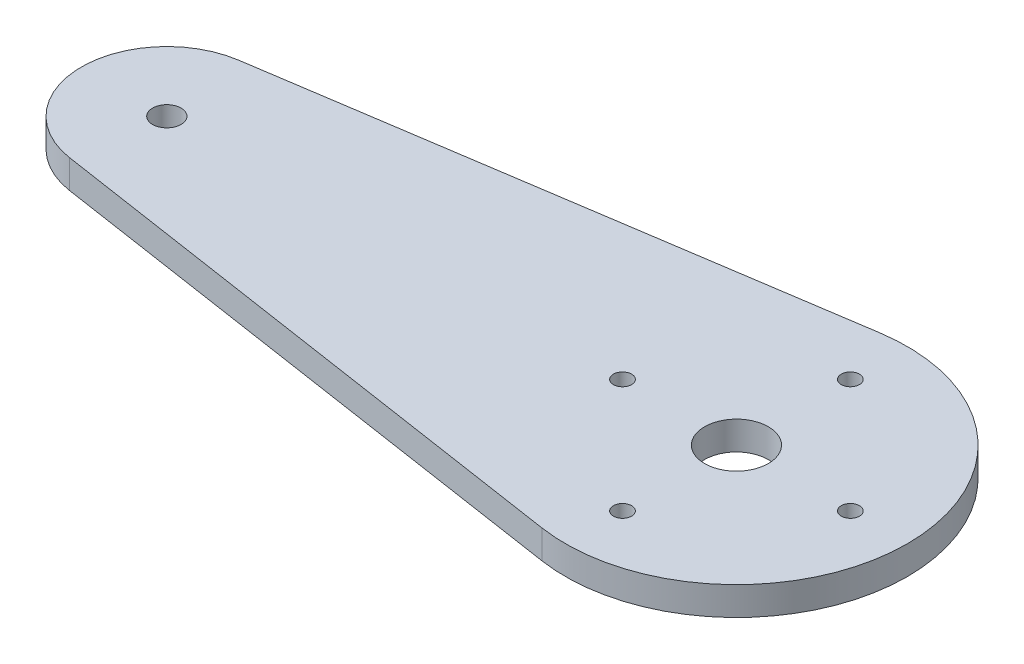
ISO-10303-21;
HEADER;
FILE_DESCRIPTION(('STEP AP214'),'2;1');
FILE_NAME('part.step','',(''),(''),'','','');
FILE_SCHEMA(('AUTOMOTIVE_DESIGN { 1 0 10303 214 1 1 1 1 }'));
ENDSEC;
DATA;
#1=APPLICATION_CONTEXT('core data for automotive mechanical design processes');
#2=APPLICATION_PROTOCOL_DEFINITION('international standard','automotive_design',2000,#1);
#3=PRODUCT_CONTEXT('',#1,'mechanical');
#4=PRODUCT('Part','Part','',(#3));
#5=PRODUCT_RELATED_PRODUCT_CATEGORY('part','',(#4));
#6=PRODUCT_DEFINITION_FORMATION('','',#4);
#7=PRODUCT_DEFINITION_CONTEXT('part definition',#1,'design');
#8=PRODUCT_DEFINITION('design','',#6,#7);
#9=PRODUCT_DEFINITION_SHAPE('','',#8);
#10=(LENGTH_UNIT() NAMED_UNIT(*) SI_UNIT(.MILLI.,.METRE.));
#11=(NAMED_UNIT(*) PLANE_ANGLE_UNIT() SI_UNIT($,.RADIAN.));
#12=(NAMED_UNIT(*) SI_UNIT($,.STERADIAN.) SOLID_ANGLE_UNIT());
#13=UNCERTAINTY_MEASURE_WITH_UNIT(LENGTH_MEASURE(1.E-05),#10,'distance_accuracy_value','');
#14=(GEOMETRIC_REPRESENTATION_CONTEXT(3) GLOBAL_UNCERTAINTY_ASSIGNED_CONTEXT((#13)) GLOBAL_UNIT_ASSIGNED_CONTEXT((#10,
#11,#12)) REPRESENTATION_CONTEXT('',''));
#15=CARTESIAN_POINT('',(0.,0.,0.));
#16=DIRECTION('',(0.,0.,1.));
#17=DIRECTION('',(1.,0.,0.));
#18=AXIS2_PLACEMENT_3D('',#15,#16,#17);
#19=CARTESIAN_POINT('',(-63.5,3.175,0.));
#20=DIRECTION('',(0.,1.,0.));
#21=DIRECTION('',(0.,0.,1.));
#22=AXIS2_PLACEMENT_3D('',#19,#20,#21);
#23=PLANE('',#22);
#24=CARTESIAN_POINT('',(-4.44089209850063E-13,3.175,12.7));
#25=DIRECTION('',(0.,1.,0.));
#26=DIRECTION('',(0.,0.,1.));
#27=AXIS2_PLACEMENT_3D('',#24,#25,#26);
#28=CIRCLE('',#27,1.016);
#29=CARTESIAN_POINT('',(-4.44089209850063E-13,3.175,13.716));
#30=VERTEX_POINT('',#29);
#31=EDGE_CURVE('E131',#30,#30,#28,.T.);
#32=ORIENTED_EDGE('',*,*,#31,.F.);
#33=EDGE_LOOP('',(#32));
#34=FACE_BOUND('',#33,.T.);
#35=CARTESIAN_POINT('',(0.,3.175,-12.7));
#36=DIRECTION('',(0.,1.,0.));
#37=DIRECTION('',(0.,0.,1.));
#38=AXIS2_PLACEMENT_3D('',#35,#36,#37);
#39=CIRCLE('',#38,1.016);
#40=CARTESIAN_POINT('',(0.,3.175,-11.684));
#41=VERTEX_POINT('',#40);
#42=EDGE_CURVE('E119',#41,#41,#39,.T.);
#43=ORIENTED_EDGE('',*,*,#42,.F.);
#44=EDGE_LOOP('',(#43));
#45=FACE_BOUND('',#44,.T.);
#46=CARTESIAN_POINT('',(-63.5,3.175,0.));
#47=DIRECTION('',(0.,1.,0.));
#48=DIRECTION('',(0.,0.,1.));
#49=AXIS2_PLACEMENT_3D('',#46,#47,#48);
#50=CIRCLE('',#49,1.58749999999998);
#51=CARTESIAN_POINT('',(-63.5,3.175,1.58749999999998));
#52=VERTEX_POINT('',#51);
#53=EDGE_CURVE('E98',#52,#52,#50,.T.);
#54=ORIENTED_EDGE('',*,*,#53,.F.);
#55=EDGE_LOOP('',(#54));
#56=FACE_BOUND('',#55,.T.);
#57=CARTESIAN_POINT('',(-63.5,3.175,0.));
#58=DIRECTION('',(0.,1.,0.));
#59=DIRECTION('',(0.,0.,1.));
#60=AXIS2_PLACEMENT_3D('',#57,#58,#59);
#61=CIRCLE('',#60,9.52500000000001);
#62=CARTESIAN_POINT('',(-64.92875,3.175,-9.41723411822709));
#63=VERTEX_POINT('',#62);
#64=CARTESIAN_POINT('',(-64.92875,3.175,9.41723411822706));
#65=VERTEX_POINT('',#64);
#66=EDGE_CURVE('E83',#63,#65,#61,.T.);
#67=ORIENTED_EDGE('',*,*,#66,.T.);
#68=DIRECTION('',(0.988685996664259,0.,0.15));
#69=VECTOR('',#68,1.);
#70=CARTESIAN_POINT('',(-64.92875,3.175,9.41723411822706));
#71=LINE('',#70,#69);
#72=CARTESIAN_POINT('',(-2.85750000000001,3.175,18.8344682364541));
#73=VERTEX_POINT('',#72);
#74=EDGE_CURVE('E78',#65,#73,#71,.T.);
#75=ORIENTED_EDGE('',*,*,#74,.T.);
#76=CARTESIAN_POINT('',(0.,3.175,0.));
#77=DIRECTION('',(0.,1.,0.));
#78=DIRECTION('',(0.,0.,1.));
#79=AXIS2_PLACEMENT_3D('',#76,#77,#78);
#80=CIRCLE('',#79,19.05);
#81=CARTESIAN_POINT('',(-2.8575,3.175,-18.8344682364542));
#82=VERTEX_POINT('',#81);
#83=EDGE_CURVE('E81',#73,#82,#80,.T.);
#84=ORIENTED_EDGE('',*,*,#83,.T.);
#85=DIRECTION('',(-0.988685996664259,0.,0.15));
#86=VECTOR('',#85,1.);
#87=CARTESIAN_POINT('',(-64.92875,3.175,-9.41723411822709));
#88=LINE('',#87,#86);
#89=EDGE_CURVE('E48',#82,#63,#88,.T.);
#90=ORIENTED_EDGE('',*,*,#89,.T.);
#91=EDGE_LOOP('',(#67,#75,#84,#90));
#92=FACE_BOUND('',#91,.T.);
#93=CARTESIAN_POINT('',(0.,3.175,0.));
#94=DIRECTION('',(0.,1.,0.));
#95=DIRECTION('',(0.,0.,1.));
#96=AXIS2_PLACEMENT_3D('',#93,#94,#95);
#97=CIRCLE('',#96,3.556);
#98=CARTESIAN_POINT('',(0.,3.175,3.556));
#99=VERTEX_POINT('',#98);
#100=EDGE_CURVE('E113',#99,#99,#97,.T.);
#101=ORIENTED_EDGE('',*,*,#100,.F.);
#102=EDGE_LOOP('',(#101));
#103=FACE_BOUND('',#102,.T.);
#104=CARTESIAN_POINT('',(12.7,3.175,2.22044604925031E-13));
#105=DIRECTION('',(0.,1.,0.));
#106=DIRECTION('',(0.,0.,1.));
#107=AXIS2_PLACEMENT_3D('',#104,#105,#106);
#108=CIRCLE('',#107,1.016);
#109=CARTESIAN_POINT('',(12.7,3.175,1.01600000000022));
#110=VERTEX_POINT('',#109);
#111=EDGE_CURVE('E125',#110,#110,#108,.T.);
#112=ORIENTED_EDGE('',*,*,#111,.F.);
#113=EDGE_LOOP('',(#112));
#114=FACE_BOUND('',#113,.T.);
#115=CARTESIAN_POINT('',(-12.7,3.175,-6.63531729561129E-13));
#116=DIRECTION('',(0.,1.,0.));
#117=DIRECTION('',(0.,0.,1.));
#118=AXIS2_PLACEMENT_3D('',#115,#116,#117);
#119=CIRCLE('',#118,1.016);
#120=CARTESIAN_POINT('',(-12.7,3.175,1.01599999999934));
#121=VERTEX_POINT('',#120);
#122=EDGE_CURVE('E137',#121,#121,#119,.T.);
#123=ORIENTED_EDGE('',*,*,#122,.F.);
#124=EDGE_LOOP('',(#123));
#125=FACE_BOUND('',#124,.T.);
#126=ADVANCED_FACE('F31',(#34,#45,#56,#92,#103,#114,#125),#23,.T.);
#127=CARTESIAN_POINT('',(-63.5,0.,0.));
#128=DIRECTION('',(0.,1.,0.));
#129=DIRECTION('',(0.,0.,1.));
#130=AXIS2_PLACEMENT_3D('',#127,#128,#129);
#131=PLANE('',#130);
#132=CARTESIAN_POINT('',(-4.44089209850063E-13,0.,12.7));
#133=DIRECTION('',(0.,1.,0.));
#134=DIRECTION('',(0.,0.,1.));
#135=AXIS2_PLACEMENT_3D('',#132,#133,#134);
#136=CIRCLE('',#135,1.016);
#137=CARTESIAN_POINT('',(-4.44089209850063E-13,0.,13.716));
#138=VERTEX_POINT('',#137);
#139=EDGE_CURVE('E134',#138,#138,#136,.T.);
#140=ORIENTED_EDGE('',*,*,#139,.T.);
#141=EDGE_LOOP('',(#140));
#142=FACE_BOUND('',#141,.T.);
#143=CARTESIAN_POINT('',(0.,0.,-12.7));
#144=DIRECTION('',(0.,1.,0.));
#145=DIRECTION('',(0.,0.,1.));
#146=AXIS2_PLACEMENT_3D('',#143,#144,#145);
#147=CIRCLE('',#146,1.016);
#148=CARTESIAN_POINT('',(0.,0.,-11.684));
#149=VERTEX_POINT('',#148);
#150=EDGE_CURVE('E122',#149,#149,#147,.T.);
#151=ORIENTED_EDGE('',*,*,#150,.T.);
#152=EDGE_LOOP('',(#151));
#153=FACE_BOUND('',#152,.T.);
#154=CARTESIAN_POINT('',(-63.5,0.,0.));
#155=DIRECTION('',(0.,1.,0.));
#156=DIRECTION('',(0.,0.,1.));
#157=AXIS2_PLACEMENT_3D('',#154,#155,#156);
#158=CIRCLE('',#157,1.58749999999998);
#159=CARTESIAN_POINT('',(-63.5,0.,1.58749999999998));
#160=VERTEX_POINT('',#159);
#161=EDGE_CURVE('E110',#160,#160,#158,.T.);
#162=ORIENTED_EDGE('',*,*,#161,.T.);
#163=EDGE_LOOP('',(#162));
#164=FACE_BOUND('',#163,.T.);
#165=CARTESIAN_POINT('',(-63.5,0.,0.));
#166=DIRECTION('',(0.,1.,0.));
#167=DIRECTION('',(0.,0.,1.));
#168=AXIS2_PLACEMENT_3D('',#165,#166,#167);
#169=CIRCLE('',#168,9.52500000000001);
#170=CARTESIAN_POINT('',(-64.92875,0.,-9.41723411822709));
#171=VERTEX_POINT('',#170);
#172=CARTESIAN_POINT('',(-64.92875,0.,9.41723411822706));
#173=VERTEX_POINT('',#172);
#174=EDGE_CURVE('E95',#171,#173,#169,.T.);
#175=ORIENTED_EDGE('',*,*,#174,.F.);
#176=DIRECTION('',(-0.988685996664259,0.,0.15));
#177=VECTOR('',#176,1.);
#178=CARTESIAN_POINT('',(-64.92875,0.,-9.41723411822709));
#179=LINE('',#178,#177);
#180=CARTESIAN_POINT('',(-2.8575,0.,-18.8344682364542));
#181=VERTEX_POINT('',#180);
#182=EDGE_CURVE('E71',#181,#171,#179,.T.);
#183=ORIENTED_EDGE('',*,*,#182,.F.);
#184=CARTESIAN_POINT('',(0.,0.,0.));
#185=DIRECTION('',(0.,1.,0.));
#186=DIRECTION('',(0.,0.,1.));
#187=AXIS2_PLACEMENT_3D('',#184,#185,#186);
#188=CIRCLE('',#187,19.05);
#189=CARTESIAN_POINT('',(-2.85750000000001,0.,18.8344682364541));
#190=VERTEX_POINT('',#189);
#191=EDGE_CURVE('E65',#190,#181,#188,.T.);
#192=ORIENTED_EDGE('',*,*,#191,.F.);
#193=DIRECTION('',(0.988685996664259,0.,0.15));
#194=VECTOR('',#193,1.);
#195=CARTESIAN_POINT('',(-64.92875,0.,9.41723411822706));
#196=LINE('',#195,#194);
#197=EDGE_CURVE('E87',#173,#190,#196,.T.);
#198=ORIENTED_EDGE('',*,*,#197,.F.);
#199=EDGE_LOOP('',(#175,#183,#192,#198));
#200=FACE_BOUND('',#199,.T.);
#201=CARTESIAN_POINT('',(0.,0.,0.));
#202=DIRECTION('',(0.,1.,0.));
#203=DIRECTION('',(0.,0.,1.));
#204=AXIS2_PLACEMENT_3D('',#201,#202,#203);
#205=CIRCLE('',#204,3.556);
#206=CARTESIAN_POINT('',(0.,0.,3.556));
#207=VERTEX_POINT('',#206);
#208=EDGE_CURVE('E116',#207,#207,#205,.T.);
#209=ORIENTED_EDGE('',*,*,#208,.T.);
#210=EDGE_LOOP('',(#209));
#211=FACE_BOUND('',#210,.T.);
#212=CARTESIAN_POINT('',(12.7,0.,2.22044604925031E-13));
#213=DIRECTION('',(0.,1.,0.));
#214=DIRECTION('',(0.,0.,1.));
#215=AXIS2_PLACEMENT_3D('',#212,#213,#214);
#216=CIRCLE('',#215,1.016);
#217=CARTESIAN_POINT('',(12.7,0.,1.01600000000022));
#218=VERTEX_POINT('',#217);
#219=EDGE_CURVE('E128',#218,#218,#216,.T.);
#220=ORIENTED_EDGE('',*,*,#219,.T.);
#221=EDGE_LOOP('',(#220));
#222=FACE_BOUND('',#221,.T.);
#223=CARTESIAN_POINT('',(-12.7,0.,-6.63531729561129E-13));
#224=DIRECTION('',(0.,1.,0.));
#225=DIRECTION('',(0.,0.,1.));
#226=AXIS2_PLACEMENT_3D('',#223,#224,#225);
#227=CIRCLE('',#226,1.016);
#228=CARTESIAN_POINT('',(-12.7,0.,1.01599999999934));
#229=VERTEX_POINT('',#228);
#230=EDGE_CURVE('E140',#229,#229,#227,.T.);
#231=ORIENTED_EDGE('',*,*,#230,.T.);
#232=EDGE_LOOP('',(#231));
#233=FACE_BOUND('',#232,.T.);
#234=ADVANCED_FACE('F106',(#142,#153,#164,#200,#211,#222,#233),#131,.F.);
#235=CARTESIAN_POINT('',(-63.5,3.175,0.));
#236=DIRECTION('',(0.,-1.,0.));
#237=DIRECTION('',(0.,0.,-1.));
#238=AXIS2_PLACEMENT_3D('',#235,#236,#237);
#239=CYLINDRICAL_SURFACE('',#238,9.52500000000001);
#240=ORIENTED_EDGE('',*,*,#174,.T.);
#241=DIRECTION('',(0.,-1.,0.));
#242=VECTOR('',#241,1.);
#243=CARTESIAN_POINT('',(-64.92875,3.175,9.41723411822706));
#244=LINE('',#243,#242);
#245=EDGE_CURVE('E11',#65,#173,#244,.T.);
#246=ORIENTED_EDGE('',*,*,#245,.F.);
#247=ORIENTED_EDGE('',*,*,#66,.F.);
#248=DIRECTION('',(0.,-1.,0.));
#249=VECTOR('',#248,1.);
#250=CARTESIAN_POINT('',(-64.92875,3.175,-9.41723411822709));
#251=LINE('',#250,#249);
#252=EDGE_CURVE('E91',#63,#171,#251,.T.);
#253=ORIENTED_EDGE('',*,*,#252,.T.);
#254=EDGE_LOOP('',(#240,#246,#247,#253));
#255=FACE_BOUND('',#254,.T.);
#256=ADVANCED_FACE('F33',(#255),#239,.T.);
#257=CARTESIAN_POINT('',(-64.92875,3.175,9.41723411822706));
#258=DIRECTION('',(0.15,0.,-0.988685996664259));
#259=DIRECTION('',(-0.988685996664259,0.,-0.15));
#260=AXIS2_PLACEMENT_3D('',#257,#258,#259);
#261=PLANE('',#260);
#262=ORIENTED_EDGE('',*,*,#197,.T.);
#263=DIRECTION('',(0.,-1.,0.));
#264=VECTOR('',#263,1.);
#265=CARTESIAN_POINT('',(-2.85750000000001,3.175,18.8344682364541));
#266=LINE('',#265,#264);
#267=EDGE_CURVE('E40',#73,#190,#266,.T.);
#268=ORIENTED_EDGE('',*,*,#267,.F.);
#269=ORIENTED_EDGE('',*,*,#74,.F.);
#270=ORIENTED_EDGE('',*,*,#245,.T.);
#271=EDGE_LOOP('',(#262,#268,#269,#270));
#272=FACE_BOUND('',#271,.T.);
#273=ADVANCED_FACE('F86',(#272),#261,.F.);
#274=CARTESIAN_POINT('',(0.,3.175,0.));
#275=DIRECTION('',(0.,-1.,0.));
#276=DIRECTION('',(0.,0.,-1.));
#277=AXIS2_PLACEMENT_3D('',#274,#275,#276);
#278=CYLINDRICAL_SURFACE('',#277,19.05);
#279=ORIENTED_EDGE('',*,*,#191,.T.);
#280=DIRECTION('',(0.,-1.,0.));
#281=VECTOR('',#280,1.);
#282=CARTESIAN_POINT('',(-2.8575,3.175,-18.8344682364542));
#283=LINE('',#282,#281);
#284=EDGE_CURVE('E88',#82,#181,#283,.T.);
#285=ORIENTED_EDGE('',*,*,#284,.F.);
#286=ORIENTED_EDGE('',*,*,#83,.F.);
#287=ORIENTED_EDGE('',*,*,#267,.T.);
#288=EDGE_LOOP('',(#279,#285,#286,#287));
#289=FACE_BOUND('',#288,.T.);
#290=ADVANCED_FACE('F89',(#289),#278,.T.);
#291=CARTESIAN_POINT('',(-64.92875,3.175,-9.41723411822709));
#292=DIRECTION('',(0.15,0.,0.988685996664259));
#293=DIRECTION('',(0.988685996664259,0.,-0.15));
#294=AXIS2_PLACEMENT_3D('',#291,#292,#293);
#295=PLANE('',#294);
#296=ORIENTED_EDGE('',*,*,#182,.T.);
#297=ORIENTED_EDGE('',*,*,#252,.F.);
#298=ORIENTED_EDGE('',*,*,#89,.F.);
#299=ORIENTED_EDGE('',*,*,#284,.T.);
#300=EDGE_LOOP('',(#296,#297,#298,#299));
#301=FACE_BOUND('',#300,.T.);
#302=ADVANCED_FACE('F103',(#301),#295,.F.);
#303=CARTESIAN_POINT('',(-63.5,3.175,0.));
#304=DIRECTION('',(0.,-1.,0.));
#305=DIRECTION('',(0.,0.,-1.));
#306=AXIS2_PLACEMENT_3D('',#303,#304,#305);
#307=CYLINDRICAL_SURFACE('',#306,1.58749999999998);
#308=ORIENTED_EDGE('',*,*,#53,.T.);
#309=EDGE_LOOP('',(#308));
#310=FACE_BOUND('',#309,.T.);
#311=ORIENTED_EDGE('',*,*,#161,.F.);
#312=EDGE_LOOP('',(#311));
#313=FACE_BOUND('',#312,.T.);
#314=ADVANCED_FACE('F160',(#310,#313),#307,.F.);
#315=CARTESIAN_POINT('',(0.,3.175,0.));
#316=DIRECTION('',(0.,-1.,0.));
#317=DIRECTION('',(0.,0.,-1.));
#318=AXIS2_PLACEMENT_3D('',#315,#316,#317);
#319=CYLINDRICAL_SURFACE('',#318,3.556);
#320=ORIENTED_EDGE('',*,*,#100,.T.);
#321=EDGE_LOOP('',(#320));
#322=FACE_BOUND('',#321,.T.);
#323=ORIENTED_EDGE('',*,*,#208,.F.);
#324=EDGE_LOOP('',(#323));
#325=FACE_BOUND('',#324,.T.);
#326=ADVANCED_FACE('F206',(#322,#325),#319,.F.);
#327=CARTESIAN_POINT('',(0.,3.175,-12.7));
#328=DIRECTION('',(0.,-1.,0.));
#329=DIRECTION('',(0.,0.,-1.));
#330=AXIS2_PLACEMENT_3D('',#327,#328,#329);
#331=CYLINDRICAL_SURFACE('',#330,1.016);
#332=ORIENTED_EDGE('',*,*,#42,.T.);
#333=EDGE_LOOP('',(#332));
#334=FACE_BOUND('',#333,.T.);
#335=ORIENTED_EDGE('',*,*,#150,.F.);
#336=EDGE_LOOP('',(#335));
#337=FACE_BOUND('',#336,.T.);
#338=ADVANCED_FACE('F214',(#334,#337),#331,.F.);
#339=CARTESIAN_POINT('',(12.7,3.175,2.22044604925031E-13));
#340=DIRECTION('',(0.,-1.,0.));
#341=DIRECTION('',(0.,0.,-1.));
#342=AXIS2_PLACEMENT_3D('',#339,#340,#341);
#343=CYLINDRICAL_SURFACE('',#342,1.016);
#344=ORIENTED_EDGE('',*,*,#111,.T.);
#345=EDGE_LOOP('',(#344));
#346=FACE_BOUND('',#345,.T.);
#347=ORIENTED_EDGE('',*,*,#219,.F.);
#348=EDGE_LOOP('',(#347));
#349=FACE_BOUND('',#348,.T.);
#350=ADVANCED_FACE('F222',(#346,#349),#343,.F.);
#351=CARTESIAN_POINT('',(-4.44089209850063E-13,3.175,12.7));
#352=DIRECTION('',(0.,-1.,0.));
#353=DIRECTION('',(0.,0.,-1.));
#354=AXIS2_PLACEMENT_3D('',#351,#352,#353);
#355=CYLINDRICAL_SURFACE('',#354,1.016);
#356=ORIENTED_EDGE('',*,*,#31,.T.);
#357=EDGE_LOOP('',(#356));
#358=FACE_BOUND('',#357,.T.);
#359=ORIENTED_EDGE('',*,*,#139,.F.);
#360=EDGE_LOOP('',(#359));
#361=FACE_BOUND('',#360,.T.);
#362=ADVANCED_FACE('F231',(#358,#361),#355,.F.);
#363=CARTESIAN_POINT('',(-12.7,3.175,-6.63531729561129E-13));
#364=DIRECTION('',(0.,-1.,0.));
#365=DIRECTION('',(0.,0.,-1.));
#366=AXIS2_PLACEMENT_3D('',#363,#364,#365);
#367=CYLINDRICAL_SURFACE('',#366,1.016);
#368=ORIENTED_EDGE('',*,*,#122,.T.);
#369=EDGE_LOOP('',(#368));
#370=FACE_BOUND('',#369,.T.);
#371=ORIENTED_EDGE('',*,*,#230,.F.);
#372=EDGE_LOOP('',(#371));
#373=FACE_BOUND('',#372,.T.);
#374=ADVANCED_FACE('F146',(#370,#373),#367,.F.);
#375=CLOSED_SHELL('',(#126,#234,#256,#273,#290,#302,#314,#326,#338,#350,#362,#374));
#376=MANIFOLD_SOLID_BREP('B2',#375);
#377=ADVANCED_BREP_SHAPE_REPRESENTATION('',(#18,#376),#14);
#378=SHAPE_DEFINITION_REPRESENTATION(#9,#377);
ENDSEC;
END-ISO-10303-21;
